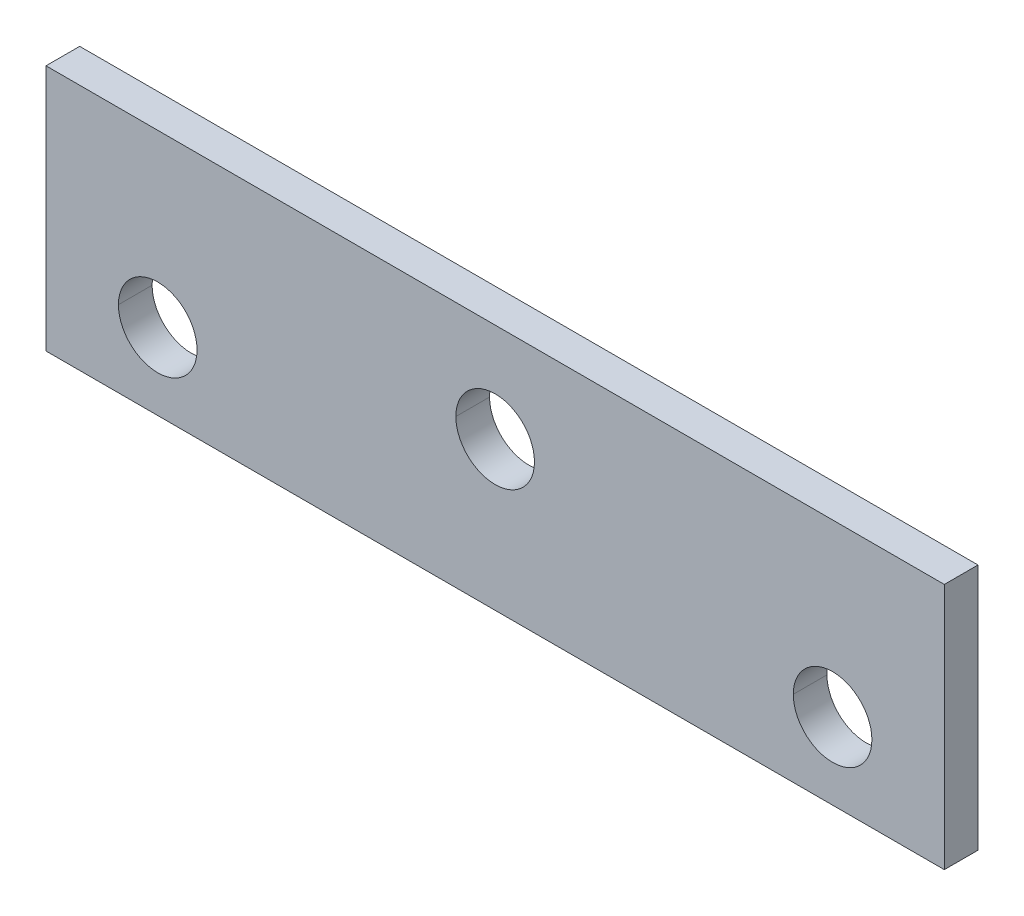
ISO-10303-21;
HEADER;
FILE_DESCRIPTION(('STEP AP214'),'2;1');
FILE_NAME('part.step','',(''),(''),'','','');
FILE_SCHEMA(('AUTOMOTIVE_DESIGN { 1 0 10303 214 1 1 1 1 }'));
ENDSEC;
DATA;
#1=APPLICATION_CONTEXT('core data for automotive mechanical design processes');
#2=APPLICATION_PROTOCOL_DEFINITION('international standard','automotive_design',2000,#1);
#3=PRODUCT_CONTEXT('',#1,'mechanical');
#4=PRODUCT('Part','Part','',(#3));
#5=PRODUCT_RELATED_PRODUCT_CATEGORY('part','',(#4));
#6=PRODUCT_DEFINITION_FORMATION('','',#4);
#7=PRODUCT_DEFINITION_CONTEXT('part definition',#1,'design');
#8=PRODUCT_DEFINITION('design','',#6,#7);
#9=PRODUCT_DEFINITION_SHAPE('','',#8);
#10=(LENGTH_UNIT() NAMED_UNIT(*) SI_UNIT(.MILLI.,.METRE.));
#11=(NAMED_UNIT(*) PLANE_ANGLE_UNIT() SI_UNIT($,.RADIAN.));
#12=(NAMED_UNIT(*) SI_UNIT($,.STERADIAN.) SOLID_ANGLE_UNIT());
#13=UNCERTAINTY_MEASURE_WITH_UNIT(LENGTH_MEASURE(1.E-05),#10,'distance_accuracy_value','');
#14=(GEOMETRIC_REPRESENTATION_CONTEXT(3) GLOBAL_UNCERTAINTY_ASSIGNED_CONTEXT((#13)) GLOBAL_UNIT_ASSIGNED_CONTEXT((#10,
#11,#12)) REPRESENTATION_CONTEXT('',''));
#15=CARTESIAN_POINT('',(0.,0.,0.));
#16=DIRECTION('',(0.,0.,1.));
#17=DIRECTION('',(1.,0.,0.));
#18=AXIS2_PLACEMENT_3D('',#15,#16,#17);
#19=CARTESIAN_POINT('',(30.05,-4.2,0.));
#20=DIRECTION('',(0.,0.,1.));
#21=DIRECTION('',(1.,0.,0.));
#22=AXIS2_PLACEMENT_3D('',#19,#20,#21);
#23=CYLINDRICAL_SURFACE('',#22,3.5);
#24=DIRECTION('',(0.,0.,1.));
#25=VECTOR('',#24,1.);
#26=CARTESIAN_POINT('',(26.55,-4.2,0.));
#27=LINE('',#26,#25);
#28=CARTESIAN_POINT('',(26.55,-4.2,0.));
#29=VERTEX_POINT('',#28);
#30=CARTESIAN_POINT('',(26.55,-4.2,3.));
#31=VERTEX_POINT('',#30);
#32=EDGE_CURVE('E214',#29,#31,#27,.T.);
#33=ORIENTED_EDGE('',*,*,#32,.F.);
#34=CARTESIAN_POINT('',(30.05,-4.2,0.));
#35=DIRECTION('',(0.,0.,1.));
#36=DIRECTION('',(-1.,0.,0.));
#37=AXIS2_PLACEMENT_3D('',#34,#35,#36);
#38=CIRCLE('',#37,3.5);
#39=CARTESIAN_POINT('',(33.55,-4.2,0.));
#40=VERTEX_POINT('',#39);
#41=EDGE_CURVE('E136',#40,#29,#38,.T.);
#42=ORIENTED_EDGE('',*,*,#41,.F.);
#43=DIRECTION('',(0.,0.,1.));
#44=VECTOR('',#43,1.);
#45=CARTESIAN_POINT('',(33.55,-4.2,0.));
#46=LINE('',#45,#44);
#47=CARTESIAN_POINT('',(33.55,-4.2,3.));
#48=VERTEX_POINT('',#47);
#49=EDGE_CURVE('E169',#40,#48,#46,.T.);
#50=ORIENTED_EDGE('',*,*,#49,.T.);
#51=CARTESIAN_POINT('',(30.05,-4.2,3.));
#52=DIRECTION('',(0.,0.,1.));
#53=DIRECTION('',(-1.,0.,0.));
#54=AXIS2_PLACEMENT_3D('',#51,#52,#53);
#55=CIRCLE('',#54,3.5);
#56=EDGE_CURVE('E121',#48,#31,#55,.T.);
#57=ORIENTED_EDGE('',*,*,#56,.T.);
#58=EDGE_LOOP('',(#33,#42,#50,#57));
#59=FACE_BOUND('',#58,.T.);
#60=ADVANCED_FACE('F17',(#59),#23,.F.);
#61=CARTESIAN_POINT('',(-30.05,-4.2,0.));
#62=DIRECTION('',(0.,0.,1.));
#63=DIRECTION('',(1.,0.,0.));
#64=AXIS2_PLACEMENT_3D('',#61,#62,#63);
#65=CYLINDRICAL_SURFACE('',#64,3.5);
#66=DIRECTION('',(0.,0.,1.));
#67=VECTOR('',#66,1.);
#68=CARTESIAN_POINT('',(-33.55,-4.2,0.));
#69=LINE('',#68,#67);
#70=CARTESIAN_POINT('',(-33.55,-4.2,0.));
#71=VERTEX_POINT('',#70);
#72=CARTESIAN_POINT('',(-33.55,-4.2,3.));
#73=VERTEX_POINT('',#72);
#74=EDGE_CURVE('E158',#71,#73,#69,.T.);
#75=ORIENTED_EDGE('',*,*,#74,.F.);
#76=CARTESIAN_POINT('',(-30.05,-4.2,0.));
#77=DIRECTION('',(0.,0.,1.));
#78=DIRECTION('',(1.,0.,0.));
#79=AXIS2_PLACEMENT_3D('',#76,#77,#78);
#80=CIRCLE('',#79,3.5);
#81=CARTESIAN_POINT('',(-26.55,-4.2,0.));
#82=VERTEX_POINT('',#81);
#83=EDGE_CURVE('E27',#82,#71,#80,.T.);
#84=ORIENTED_EDGE('',*,*,#83,.F.);
#85=DIRECTION('',(0.,0.,1.));
#86=VECTOR('',#85,1.);
#87=CARTESIAN_POINT('',(-26.55,-4.2,0.));
#88=LINE('',#87,#86);
#89=CARTESIAN_POINT('',(-26.55,-4.2,3.));
#90=VERTEX_POINT('',#89);
#91=EDGE_CURVE('E167',#82,#90,#88,.T.);
#92=ORIENTED_EDGE('',*,*,#91,.T.);
#93=CARTESIAN_POINT('',(-30.05,-4.2,3.));
#94=DIRECTION('',(0.,0.,1.));
#95=DIRECTION('',(1.,0.,0.));
#96=AXIS2_PLACEMENT_3D('',#93,#94,#95);
#97=CIRCLE('',#96,3.5);
#98=EDGE_CURVE('E130',#90,#73,#97,.T.);
#99=ORIENTED_EDGE('',*,*,#98,.T.);
#100=EDGE_LOOP('',(#75,#84,#92,#99));
#101=FACE_BOUND('',#100,.T.);
#102=ADVANCED_FACE('F159',(#101),#65,.F.);
#103=CARTESIAN_POINT('',(0.,2.2,0.));
#104=DIRECTION('',(0.,0.,1.));
#105=DIRECTION('',(1.,0.,0.));
#106=AXIS2_PLACEMENT_3D('',#103,#104,#105);
#107=CYLINDRICAL_SURFACE('',#106,3.5);
#108=DIRECTION('',(0.,0.,1.));
#109=VECTOR('',#108,1.);
#110=CARTESIAN_POINT('',(-3.5,2.2,0.));
#111=LINE('',#110,#109);
#112=CARTESIAN_POINT('',(-3.5,2.2,0.));
#113=VERTEX_POINT('',#112);
#114=CARTESIAN_POINT('',(-3.5,2.2,3.));
#115=VERTEX_POINT('',#114);
#116=EDGE_CURVE('E189',#113,#115,#111,.T.);
#117=ORIENTED_EDGE('',*,*,#116,.F.);
#118=CARTESIAN_POINT('',(0.,2.2,0.));
#119=DIRECTION('',(0.,0.,1.));
#120=DIRECTION('',(1.,0.,0.));
#121=AXIS2_PLACEMENT_3D('',#118,#119,#120);
#122=CIRCLE('',#121,3.5);
#123=CARTESIAN_POINT('',(3.5,2.2,0.));
#124=VERTEX_POINT('',#123);
#125=EDGE_CURVE('E11',#124,#113,#122,.T.);
#126=ORIENTED_EDGE('',*,*,#125,.F.);
#127=DIRECTION('',(0.,0.,1.));
#128=VECTOR('',#127,1.);
#129=CARTESIAN_POINT('',(3.5,2.2,0.));
#130=LINE('',#129,#128);
#131=CARTESIAN_POINT('',(3.5,2.2,3.));
#132=VERTEX_POINT('',#131);
#133=EDGE_CURVE('E195',#124,#132,#130,.T.);
#134=ORIENTED_EDGE('',*,*,#133,.T.);
#135=CARTESIAN_POINT('',(0.,2.2,3.));
#136=DIRECTION('',(0.,0.,1.));
#137=DIRECTION('',(1.,0.,0.));
#138=AXIS2_PLACEMENT_3D('',#135,#136,#137);
#139=CIRCLE('',#138,3.5);
#140=EDGE_CURVE('E133',#132,#115,#139,.T.);
#141=ORIENTED_EDGE('',*,*,#140,.T.);
#142=EDGE_LOOP('',(#117,#126,#134,#141));
#143=FACE_BOUND('',#142,.T.);
#144=ADVANCED_FACE('F240',(#143),#107,.F.);
#145=CARTESIAN_POINT('',(0.,0.,0.));
#146=DIRECTION('',(0.,0.,1.));
#147=DIRECTION('',(1.,0.,0.));
#148=AXIS2_PLACEMENT_3D('',#145,#146,#147);
#149=PLANE('',#148);
#150=ORIENTED_EDGE('',*,*,#125,.T.);
#151=CARTESIAN_POINT('',(0.,2.2,0.));
#152=DIRECTION('',(0.,0.,1.));
#153=DIRECTION('',(1.,0.,0.));
#154=AXIS2_PLACEMENT_3D('',#151,#152,#153);
#155=CIRCLE('',#154,3.5);
#156=EDGE_CURVE('E185',#113,#124,#155,.T.);
#157=ORIENTED_EDGE('',*,*,#156,.T.);
#158=EDGE_LOOP('',(#150,#157));
#159=FACE_BOUND('',#158,.T.);
#160=ORIENTED_EDGE('',*,*,#83,.T.);
#161=CARTESIAN_POINT('',(-30.05,-4.2,0.));
#162=DIRECTION('',(0.,0.,1.));
#163=DIRECTION('',(1.,0.,0.));
#164=AXIS2_PLACEMENT_3D('',#161,#162,#163);
#165=CIRCLE('',#164,3.5);
#166=EDGE_CURVE('E150',#71,#82,#165,.T.);
#167=ORIENTED_EDGE('',*,*,#166,.T.);
#168=EDGE_LOOP('',(#160,#167));
#169=FACE_BOUND('',#168,.T.);
#170=ORIENTED_EDGE('',*,*,#41,.T.);
#171=CARTESIAN_POINT('',(30.05,-4.2,0.));
#172=DIRECTION('',(0.,0.,1.));
#173=DIRECTION('',(-1.,0.,0.));
#174=AXIS2_PLACEMENT_3D('',#171,#172,#173);
#175=CIRCLE('',#174,3.5);
#176=EDGE_CURVE('E217',#29,#40,#175,.T.);
#177=ORIENTED_EDGE('',*,*,#176,.T.);
#178=EDGE_LOOP('',(#170,#177));
#179=FACE_BOUND('',#178,.T.);
#180=DIRECTION('',(0.,1.,0.));
#181=VECTOR('',#180,1.);
#182=CARTESIAN_POINT('',(40.,11.,0.));
#183=LINE('',#182,#181);
#184=CARTESIAN_POINT('',(40.,-11.,0.));
#185=VERTEX_POINT('',#184);
#186=CARTESIAN_POINT('',(40.,11.,0.));
#187=VERTEX_POINT('',#186);
#188=EDGE_CURVE('E190',#185,#187,#183,.T.);
#189=ORIENTED_EDGE('',*,*,#188,.F.);
#190=DIRECTION('',(1.,0.,0.));
#191=VECTOR('',#190,1.);
#192=CARTESIAN_POINT('',(-40.,-11.,0.));
#193=LINE('',#192,#191);
#194=CARTESIAN_POINT('',(-40.,-11.,0.));
#195=VERTEX_POINT('',#194);
#196=EDGE_CURVE('E97',#195,#185,#193,.T.);
#197=ORIENTED_EDGE('',*,*,#196,.F.);
#198=DIRECTION('',(0.,-1.,0.));
#199=VECTOR('',#198,1.);
#200=CARTESIAN_POINT('',(-40.,11.,0.));
#201=LINE('',#200,#199);
#202=CARTESIAN_POINT('',(-40.,11.,0.));
#203=VERTEX_POINT('',#202);
#204=EDGE_CURVE('E108',#203,#195,#201,.T.);
#205=ORIENTED_EDGE('',*,*,#204,.F.);
#206=DIRECTION('',(-1.,0.,0.));
#207=VECTOR('',#206,1.);
#208=CARTESIAN_POINT('',(-40.,11.,0.));
#209=LINE('',#208,#207);
#210=EDGE_CURVE('E111',#187,#203,#209,.T.);
#211=ORIENTED_EDGE('',*,*,#210,.F.);
#212=EDGE_LOOP('',(#189,#197,#205,#211));
#213=FACE_BOUND('',#212,.T.);
#214=ADVANCED_FACE('F19',(#159,#169,#179,#213),#149,.F.);
#215=CARTESIAN_POINT('',(0.,0.,3.));
#216=DIRECTION('',(0.,0.,1.));
#217=DIRECTION('',(1.,0.,0.));
#218=AXIS2_PLACEMENT_3D('',#215,#216,#217);
#219=PLANE('',#218);
#220=ORIENTED_EDGE('',*,*,#140,.F.);
#221=CARTESIAN_POINT('',(0.,2.2,3.));
#222=DIRECTION('',(0.,0.,1.));
#223=DIRECTION('',(1.,0.,0.));
#224=AXIS2_PLACEMENT_3D('',#221,#222,#223);
#225=CIRCLE('',#224,3.5);
#226=EDGE_CURVE('E199',#115,#132,#225,.T.);
#227=ORIENTED_EDGE('',*,*,#226,.F.);
#228=EDGE_LOOP('',(#220,#227));
#229=FACE_BOUND('',#228,.T.);
#230=ORIENTED_EDGE('',*,*,#98,.F.);
#231=CARTESIAN_POINT('',(-30.05,-4.2,3.));
#232=DIRECTION('',(0.,0.,1.));
#233=DIRECTION('',(1.,0.,0.));
#234=AXIS2_PLACEMENT_3D('',#231,#232,#233);
#235=CIRCLE('',#234,3.5);
#236=EDGE_CURVE('E164',#73,#90,#235,.T.);
#237=ORIENTED_EDGE('',*,*,#236,.F.);
#238=EDGE_LOOP('',(#230,#237));
#239=FACE_BOUND('',#238,.T.);
#240=ORIENTED_EDGE('',*,*,#56,.F.);
#241=CARTESIAN_POINT('',(30.05,-4.2,3.));
#242=DIRECTION('',(0.,0.,1.));
#243=DIRECTION('',(-1.,0.,0.));
#244=AXIS2_PLACEMENT_3D('',#241,#242,#243);
#245=CIRCLE('',#244,3.5);
#246=EDGE_CURVE('E177',#31,#48,#245,.T.);
#247=ORIENTED_EDGE('',*,*,#246,.F.);
#248=EDGE_LOOP('',(#240,#247));
#249=FACE_BOUND('',#248,.T.);
#250=DIRECTION('',(0.,1.,0.));
#251=VECTOR('',#250,1.);
#252=CARTESIAN_POINT('',(40.,11.,3.));
#253=LINE('',#252,#251);
#254=CARTESIAN_POINT('',(40.,-11.,3.));
#255=VERTEX_POINT('',#254);
#256=CARTESIAN_POINT('',(40.,11.,3.));
#257=VERTEX_POINT('',#256);
#258=EDGE_CURVE('E103',#255,#257,#253,.T.);
#259=ORIENTED_EDGE('',*,*,#258,.T.);
#260=DIRECTION('',(-1.,0.,0.));
#261=VECTOR('',#260,1.);
#262=CARTESIAN_POINT('',(-40.,11.,3.));
#263=LINE('',#262,#261);
#264=CARTESIAN_POINT('',(-40.,11.,3.));
#265=VERTEX_POINT('',#264);
#266=EDGE_CURVE('E100',#257,#265,#263,.T.);
#267=ORIENTED_EDGE('',*,*,#266,.T.);
#268=DIRECTION('',(0.,-1.,0.));
#269=VECTOR('',#268,1.);
#270=CARTESIAN_POINT('',(-40.,11.,3.));
#271=LINE('',#270,#269);
#272=CARTESIAN_POINT('',(-40.,-11.,3.));
#273=VERTEX_POINT('',#272);
#274=EDGE_CURVE('E87',#265,#273,#271,.T.);
#275=ORIENTED_EDGE('',*,*,#274,.T.);
#276=DIRECTION('',(1.,0.,0.));
#277=VECTOR('',#276,1.);
#278=CARTESIAN_POINT('',(-40.,-11.,3.));
#279=LINE('',#278,#277);
#280=EDGE_CURVE('E40',#273,#255,#279,.T.);
#281=ORIENTED_EDGE('',*,*,#280,.T.);
#282=EDGE_LOOP('',(#259,#267,#275,#281));
#283=FACE_BOUND('',#282,.T.);
#284=ADVANCED_FACE('F101',(#229,#239,#249,#283),#219,.T.);
#285=CARTESIAN_POINT('',(-40.,-11.,3.));
#286=DIRECTION('',(0.,1.,0.));
#287=DIRECTION('',(1.,0.,0.));
#288=AXIS2_PLACEMENT_3D('',#285,#286,#287);
#289=PLANE('',#288);
#290=ORIENTED_EDGE('',*,*,#196,.T.);
#291=DIRECTION('',(0.,0.,-1.));
#292=VECTOR('',#291,1.);
#293=CARTESIAN_POINT('',(40.,-11.,3.));
#294=LINE('',#293,#292);
#295=EDGE_CURVE('E118',#255,#185,#294,.T.);
#296=ORIENTED_EDGE('',*,*,#295,.F.);
#297=ORIENTED_EDGE('',*,*,#280,.F.);
#298=DIRECTION('',(0.,0.,-1.));
#299=VECTOR('',#298,1.);
#300=CARTESIAN_POINT('',(-40.,-11.,3.));
#301=LINE('',#300,#299);
#302=EDGE_CURVE('E94',#273,#195,#301,.T.);
#303=ORIENTED_EDGE('',*,*,#302,.T.);
#304=EDGE_LOOP('',(#290,#296,#297,#303));
#305=FACE_BOUND('',#304,.T.);
#306=ADVANCED_FACE('F380',(#305),#289,.F.);
#307=CARTESIAN_POINT('',(-40.,11.,3.));
#308=DIRECTION('',(1.,0.,0.));
#309=DIRECTION('',(0.,-1.,0.));
#310=AXIS2_PLACEMENT_3D('',#307,#308,#309);
#311=PLANE('',#310);
#312=ORIENTED_EDGE('',*,*,#204,.T.);
#313=ORIENTED_EDGE('',*,*,#302,.F.);
#314=ORIENTED_EDGE('',*,*,#274,.F.);
#315=DIRECTION('',(0.,0.,-1.));
#316=VECTOR('',#315,1.);
#317=CARTESIAN_POINT('',(-40.,11.,3.));
#318=LINE('',#317,#316);
#319=EDGE_CURVE('E92',#265,#203,#318,.T.);
#320=ORIENTED_EDGE('',*,*,#319,.T.);
#321=EDGE_LOOP('',(#312,#313,#314,#320));
#322=FACE_BOUND('',#321,.T.);
#323=ADVANCED_FACE('F90',(#322),#311,.F.);
#324=CARTESIAN_POINT('',(-40.,11.,3.));
#325=DIRECTION('',(0.,-1.,0.));
#326=DIRECTION('',(0.,0.,-1.));
#327=AXIS2_PLACEMENT_3D('',#324,#325,#326);
#328=PLANE('',#327);
#329=ORIENTED_EDGE('',*,*,#210,.T.);
#330=ORIENTED_EDGE('',*,*,#319,.F.);
#331=ORIENTED_EDGE('',*,*,#266,.F.);
#332=DIRECTION('',(0.,0.,-1.));
#333=VECTOR('',#332,1.);
#334=CARTESIAN_POINT('',(40.,11.,3.));
#335=LINE('',#334,#333);
#336=EDGE_CURVE('E194',#257,#187,#335,.T.);
#337=ORIENTED_EDGE('',*,*,#336,.T.);
#338=EDGE_LOOP('',(#329,#330,#331,#337));
#339=FACE_BOUND('',#338,.T.);
#340=ADVANCED_FACE('F110',(#339),#328,.F.);
#341=CARTESIAN_POINT('',(40.,11.,3.));
#342=DIRECTION('',(-1.,0.,0.));
#343=DIRECTION('',(0.,0.,1.));
#344=AXIS2_PLACEMENT_3D('',#341,#342,#343);
#345=PLANE('',#344);
#346=ORIENTED_EDGE('',*,*,#188,.T.);
#347=ORIENTED_EDGE('',*,*,#336,.F.);
#348=ORIENTED_EDGE('',*,*,#258,.F.);
#349=ORIENTED_EDGE('',*,*,#295,.T.);
#350=EDGE_LOOP('',(#346,#347,#348,#349));
#351=FACE_BOUND('',#350,.T.);
#352=ADVANCED_FACE('F391',(#351),#345,.F.);
#353=CARTESIAN_POINT('',(0.,2.2,0.));
#354=DIRECTION('',(0.,0.,1.));
#355=DIRECTION('',(1.,0.,0.));
#356=AXIS2_PLACEMENT_3D('',#353,#354,#355);
#357=CYLINDRICAL_SURFACE('',#356,3.5);
#358=ORIENTED_EDGE('',*,*,#156,.F.);
#359=ORIENTED_EDGE('',*,*,#116,.T.);
#360=ORIENTED_EDGE('',*,*,#226,.T.);
#361=ORIENTED_EDGE('',*,*,#133,.F.);
#362=EDGE_LOOP('',(#358,#359,#360,#361));
#363=FACE_BOUND('',#362,.T.);
#364=ADVANCED_FACE('F235',(#363),#357,.F.);
#365=CARTESIAN_POINT('',(-30.05,-4.2,0.));
#366=DIRECTION('',(0.,0.,1.));
#367=DIRECTION('',(1.,0.,0.));
#368=AXIS2_PLACEMENT_3D('',#365,#366,#367);
#369=CYLINDRICAL_SURFACE('',#368,3.5);
#370=ORIENTED_EDGE('',*,*,#166,.F.);
#371=ORIENTED_EDGE('',*,*,#74,.T.);
#372=ORIENTED_EDGE('',*,*,#236,.T.);
#373=ORIENTED_EDGE('',*,*,#91,.F.);
#374=EDGE_LOOP('',(#370,#371,#372,#373));
#375=FACE_BOUND('',#374,.T.);
#376=ADVANCED_FACE('F166',(#375),#369,.F.);
#377=CARTESIAN_POINT('',(30.05,-4.2,0.));
#378=DIRECTION('',(0.,0.,1.));
#379=DIRECTION('',(1.,0.,0.));
#380=AXIS2_PLACEMENT_3D('',#377,#378,#379);
#381=CYLINDRICAL_SURFACE('',#380,3.5);
#382=ORIENTED_EDGE('',*,*,#176,.F.);
#383=ORIENTED_EDGE('',*,*,#32,.T.);
#384=ORIENTED_EDGE('',*,*,#246,.T.);
#385=ORIENTED_EDGE('',*,*,#49,.F.);
#386=EDGE_LOOP('',(#382,#383,#384,#385));
#387=FACE_BOUND('',#386,.T.);
#388=ADVANCED_FACE('F428',(#387),#381,.F.);
#389=CLOSED_SHELL('',(#60,#102,#144,#214,#284,#306,#323,#340,#352,#364,#376,#388));
#390=MANIFOLD_SOLID_BREP('B1',#389);
#391=ADVANCED_BREP_SHAPE_REPRESENTATION('',(#18,#390),#14);
#392=SHAPE_DEFINITION_REPRESENTATION(#9,#391);
ENDSEC;
END-ISO-10303-21;
